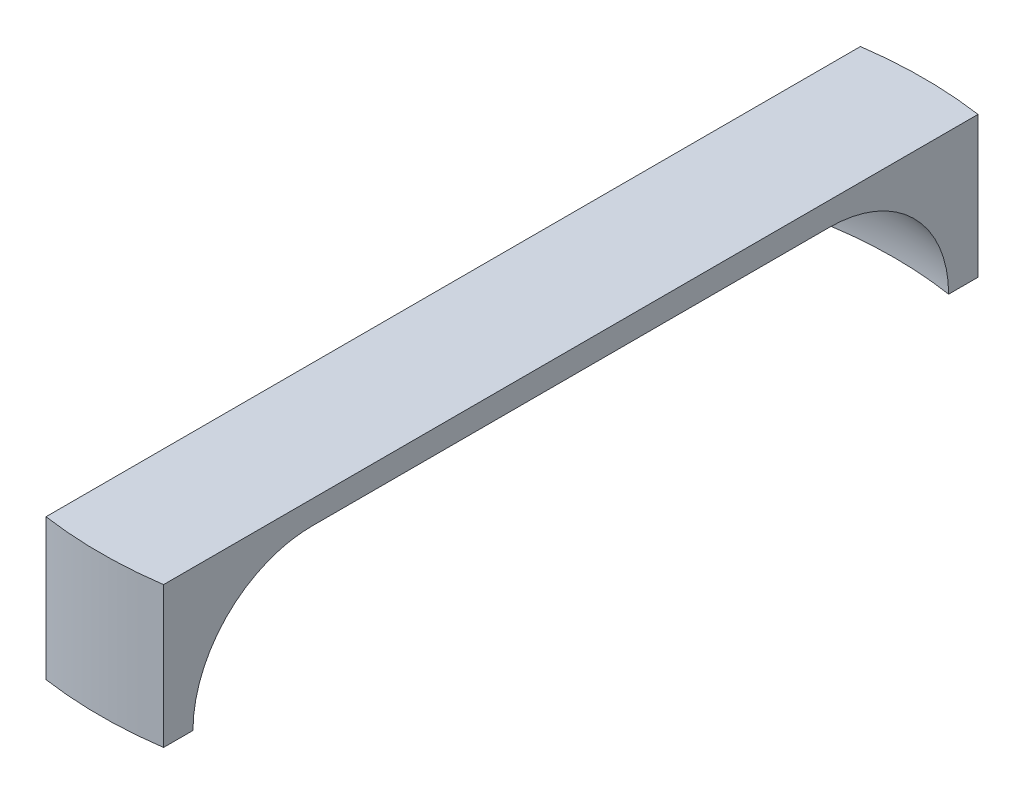
ISO-10303-21;
HEADER;
FILE_DESCRIPTION(('STEP AP214'),'2;1');
FILE_NAME('part.step','',(''),(''),'','','');
FILE_SCHEMA(('AUTOMOTIVE_DESIGN { 1 0 10303 214 1 1 1 1 }'));
ENDSEC;
DATA;
#1=APPLICATION_CONTEXT('core data for automotive mechanical design processes');
#2=APPLICATION_PROTOCOL_DEFINITION('international standard','automotive_design',2000,#1);
#3=PRODUCT_CONTEXT('',#1,'mechanical');
#4=PRODUCT('Part','Part','',(#3));
#5=PRODUCT_RELATED_PRODUCT_CATEGORY('part','',(#4));
#6=PRODUCT_DEFINITION_FORMATION('','',#4);
#7=PRODUCT_DEFINITION_CONTEXT('part definition',#1,'design');
#8=PRODUCT_DEFINITION('design','',#6,#7);
#9=PRODUCT_DEFINITION_SHAPE('','',#8);
#10=(LENGTH_UNIT() NAMED_UNIT(*) SI_UNIT(.MILLI.,.METRE.));
#11=(NAMED_UNIT(*) PLANE_ANGLE_UNIT() SI_UNIT($,.RADIAN.));
#12=(NAMED_UNIT(*) SI_UNIT($,.STERADIAN.) SOLID_ANGLE_UNIT());
#13=UNCERTAINTY_MEASURE_WITH_UNIT(LENGTH_MEASURE(1.E-05),#10,'distance_accuracy_value','');
#14=(GEOMETRIC_REPRESENTATION_CONTEXT(3) GLOBAL_UNCERTAINTY_ASSIGNED_CONTEXT((#13)) GLOBAL_UNIT_ASSIGNED_CONTEXT((#10,
#11,#12)) REPRESENTATION_CONTEXT('',''));
#15=CARTESIAN_POINT('',(0.,0.,0.));
#16=DIRECTION('',(0.,0.,1.));
#17=DIRECTION('',(1.,0.,0.));
#18=AXIS2_PLACEMENT_3D('',#15,#16,#17);
#19=CARTESIAN_POINT('',(0.,0.,0.));
#20=DIRECTION('',(0.,-1.,0.));
#21=DIRECTION('',(0.,0.,-1.));
#22=AXIS2_PLACEMENT_3D('',#19,#20,#21);
#23=PLANE('',#22);
#24=DIRECTION('',(0.,0.,-1.));
#25=VECTOR('',#24,1.);
#26=CARTESIAN_POINT('',(10.,0.,-69.2820323027551));
#27=LINE('',#26,#25);
#28=CARTESIAN_POINT('',(10.,0.,43.931440715182));
#29=VERTEX_POINT('',#28);
#30=CARTESIAN_POINT('',(10.,0.,-43.931440715182));
#31=VERTEX_POINT('',#30);
#32=EDGE_CURVE('E143',#29,#31,#27,.T.);
#33=ORIENTED_EDGE('',*,*,#32,.F.);
#34=CARTESIAN_POINT('',(0.,0.,0.));
#35=DIRECTION('',(0.,-1.,0.));
#36=DIRECTION('',(0.,0.,-1.));
#37=AXIS2_PLACEMENT_3D('',#34,#35,#36);
#38=CIRCLE('',#37,45.0552048415225);
#39=CARTESIAN_POINT('',(-10.,0.,43.931440715182));
#40=VERTEX_POINT('',#39);
#41=EDGE_CURVE('E55',#29,#40,#38,.T.);
#42=ORIENTED_EDGE('',*,*,#41,.T.);
#43=DIRECTION('',(0.,0.,1.));
#44=VECTOR('',#43,1.);
#45=CARTESIAN_POINT('',(-10.,0.,-69.2820323027551));
#46=LINE('',#45,#44);
#47=CARTESIAN_POINT('',(-10.,0.,-43.931440715182));
#48=VERTEX_POINT('',#47);
#49=EDGE_CURVE('E148',#48,#40,#46,.T.);
#50=ORIENTED_EDGE('',*,*,#49,.F.);
#51=CARTESIAN_POINT('',(0.,0.,0.));
#52=DIRECTION('',(0.,-1.,0.));
#53=DIRECTION('',(0.,0.,-1.));
#54=AXIS2_PLACEMENT_3D('',#51,#52,#53);
#55=CIRCLE('',#54,45.0552048415225);
#56=EDGE_CURVE('E163',#48,#31,#55,.T.);
#57=ORIENTED_EDGE('',*,*,#56,.T.);
#58=EDGE_LOOP('',(#33,#42,#50,#57));
#59=FACE_BOUND('',#58,.T.);
#60=ADVANCED_FACE('F35',(#59),#23,.T.);
#61=CARTESIAN_POINT('',(0.,4.,0.));
#62=DIRECTION('',(0.,-1.,0.));
#63=DIRECTION('',(0.,0.,-1.));
#64=AXIS2_PLACEMENT_3D('',#61,#62,#63);
#65=CYLINDRICAL_SURFACE('',#64,70.);
#66=DIRECTION('',(0.,-1.,0.));
#67=VECTOR('',#66,1.);
#68=CARTESIAN_POINT('',(-10.,4.,69.2820323027551));
#69=LINE('',#68,#67);
#70=CARTESIAN_POINT('',(-10.,4.,69.2820323027551));
#71=VERTEX_POINT('',#70);
#72=CARTESIAN_POINT('',(-10.,-20.,69.2820323027551));
#73=VERTEX_POINT('',#72);
#74=EDGE_CURVE('E154',#71,#73,#69,.T.);
#75=ORIENTED_EDGE('',*,*,#74,.T.);
#76=CARTESIAN_POINT('',(0.,-20.,0.));
#77=DIRECTION('',(0.,-1.,0.));
#78=DIRECTION('',(0.,0.,-1.));
#79=AXIS2_PLACEMENT_3D('',#76,#77,#78);
#80=CIRCLE('',#79,70.);
#81=CARTESIAN_POINT('',(10.,-20.,69.2820323027551));
#82=VERTEX_POINT('',#81);
#83=EDGE_CURVE('E121',#82,#73,#80,.T.);
#84=ORIENTED_EDGE('',*,*,#83,.F.);
#85=DIRECTION('',(0.,-1.,0.));
#86=VECTOR('',#85,1.);
#87=CARTESIAN_POINT('',(10.,4.,69.2820323027551));
#88=LINE('',#87,#86);
#89=CARTESIAN_POINT('',(10.,4.,69.2820323027551));
#90=VERTEX_POINT('',#89);
#91=EDGE_CURVE('E117',#90,#82,#88,.T.);
#92=ORIENTED_EDGE('',*,*,#91,.F.);
#93=CARTESIAN_POINT('',(0.,4.,0.));
#94=DIRECTION('',(0.,1.,0.));
#95=DIRECTION('',(0.,0.,-1.));
#96=AXIS2_PLACEMENT_3D('',#93,#94,#95);
#97=CIRCLE('',#96,70.);
#98=EDGE_CURVE('E144',#71,#90,#97,.T.);
#99=ORIENTED_EDGE('',*,*,#98,.F.);
#100=EDGE_LOOP('',(#75,#84,#92,#99));
#101=FACE_BOUND('',#100,.T.);
#102=ADVANCED_FACE('F178',(#101),#65,.T.);
#103=CARTESIAN_POINT('',(10.,4.,-69.2820323027551));
#104=DIRECTION('',(-1.,0.,0.));
#105=DIRECTION('',(0.,0.,1.));
#106=AXIS2_PLACEMENT_3D('',#103,#104,#105);
#107=PLANE('',#106);
#108=ORIENTED_EDGE('',*,*,#91,.T.);
#109=DIRECTION('',(0.,0.,1.));
#110=VECTOR('',#109,1.);
#111=CARTESIAN_POINT('',(10.,-20.,69.2820323027551));
#112=LINE('',#111,#110);
#113=CARTESIAN_POINT('',(10.,-20.,64.2820323027551));
#114=VERTEX_POINT('',#113);
#115=EDGE_CURVE('E114',#114,#82,#112,.T.);
#116=ORIENTED_EDGE('',*,*,#115,.F.);
#117=CARTESIAN_POINT('',(10.,-20.,64.2820323027551));
#118=CARTESIAN_POINT('',(10.,-19.7213822906956,64.2820327805648));
#119=CARTESIAN_POINT('',(10.,-19.4427957540815,64.2761394636097));
#120=CARTESIAN_POINT('',(10.,-18.8861275624752,64.252583538269));
#121=CARTESIAN_POINT('',(10.,-18.6080458952483,64.2349212190047));
#122=CARTESIAN_POINT('',(10.,-17.7753547787992,64.1643207709864));
#123=CARTESIAN_POINT('',(10.,-17.2221448276563,64.0937691304236));
#124=CARTESIAN_POINT('',(10.,-16.1242237067101,63.9062964400513));
#125=CARTESIAN_POINT('',(10.,-15.5795044109415,63.7894229673086));
#126=CARTESIAN_POINT('',(10.,-14.7714169253622,63.5800570999904));
#127=CARTESIAN_POINT('',(10.,-14.5035416556201,63.5045885480528));
#128=CARTESIAN_POINT('',(10.,-13.9711402617083,63.3424143375278));
#129=CARTESIAN_POINT('',(10.,-13.7066150041821,63.2557058338311));
#130=CARTESIAN_POINT('',(10.,-12.9187623997687,62.9789349397263));
#131=CARTESIAN_POINT('',(10.,-12.4011822930906,62.7722334072331));
#132=CARTESIAN_POINT('',(10.,-11.3852352487672,62.3160431658329));
#133=CARTESIAN_POINT('',(10.,-10.8868684155709,62.0665542243612));
#134=CARTESIAN_POINT('',(10.,-10.1564287247783,61.6616946032974));
#135=CARTESIAN_POINT('',(10.,-9.91577279123313,61.5216184174548));
#136=CARTESIAN_POINT('',(10.,-9.44060667017812,61.2315388112206));
#137=CARTESIAN_POINT('',(10.,-9.20609492283176,61.081537945195));
#138=CARTESIAN_POINT('',(10.,-8.51225716021974,60.6169662223786));
#139=CARTESIAN_POINT('',(10.,-8.06258304367639,60.2878009637344));
#140=CARTESIAN_POINT('',(10.,-7.19056286658054,59.5917130630381));
#141=CARTESIAN_POINT('',(10.,-6.76833574057444,59.2246419061475));
#142=CARTESIAN_POINT('',(10.,-5.95601063145519,58.4564972033109));
#143=CARTESIAN_POINT('',(10.,-5.56591283384609,58.0554234610724));
#144=CARTESIAN_POINT('',(10.,-4.82041812281843,57.2221342838884));
#145=CARTESIAN_POINT('',(10.,-4.46502626467463,56.7899143280662));
#146=CARTESIAN_POINT('',(10.,-3.79132700273422,55.8974892786472));
#147=CARTESIAN_POINT('',(10.,-3.47301941335935,55.4372843251115));
#148=CARTESIAN_POINT('',(10.,-2.87210973022331,54.4867732335737));
#149=CARTESIAN_POINT('',(10.,-2.58995529280496,53.9961840944205));
#150=CARTESIAN_POINT('',(10.,-2.06741301783768,52.9932149671854));
#151=CARTESIAN_POINT('',(10.,-1.82702755573707,52.4808337418247));
#152=CARTESIAN_POINT('',(10.,-1.38953024363979,51.4380425732833));
#153=CARTESIAN_POINT('',(10.,-1.1924107848744,50.9076358190535));
#154=CARTESIAN_POINT('',(10.,-0.842532045945097,49.8324634426785));
#155=CARTESIAN_POINT('',(10.,-0.689764380619027,49.2877005559788));
#156=CARTESIAN_POINT('',(10.,-0.466381088863208,48.3440602979897));
#157=CARTESIAN_POINT('',(10.,-0.384757580362428,47.9477482664143));
#158=CARTESIAN_POINT('',(10.,-0.24477796682238,47.1510397577513));
#159=CARTESIAN_POINT('',(10.,-0.186420515109505,46.7506435184399));
#160=CARTESIAN_POINT('',(10.,-0.0931592200956664,45.9478125907846));
#161=CARTESIAN_POINT('',(10.,-0.0582165071317918,45.5453824037196));
#162=CARTESIAN_POINT('',(10.,-0.0116284519308462,44.7391145184016));
#163=CARTESIAN_POINT('',(10.,1.33993457781367E-05,44.3352766183214));
#164=CARTESIAN_POINT('',(10.,0.,43.931440715182));
#165=B_SPLINE_CURVE_WITH_KNOTS('',3,(#117,#118,#119,#120,#121,#122,#123,#124,#125,#126,#127,
#128,#129,#130,#131,#132,#133,#134,#135,#136,#137,#138,#139,#140,#141,#142,#143,#144,#145,#146,
#147,#148,#149,#150,#151,#152,#153,#154,#155,#156,#157,#158,#159,#160,#161,#162,#163,#164),
.UNSPECIFIED.,.F.,.F.,(4,2,2,2,2,2,2,2,2,2,2,2,2,2,2,2,2,2,2,2,2,2,2,4),(0.,0.835728601775882,
1.67143667351676,3.34239116788472,5.01163385717317,5.84632715085222,6.68123214007874,
8.35111648017794,10.0210098969755,10.8561566677647,11.6910893224239,13.36079876686,
15.0373179660065,16.7138468441376,18.3906195627206,20.0673838899845,21.7632339166193,
23.459180356597,25.1548283076776,26.8501554700178,28.0634047185153,29.2765837321618,
30.4877437841245,31.6990852798247),.UNSPECIFIED.);
#166=EDGE_CURVE('E103',#114,#29,#165,.T.);
#167=ORIENTED_EDGE('',*,*,#166,.T.);
#168=ORIENTED_EDGE('',*,*,#32,.T.);
#169=CARTESIAN_POINT('',(10.,0.,-43.931440715182));
#170=CARTESIAN_POINT('',(10.,2.69115547152669E-07,-44.2220826211795));
#171=CARTESIAN_POINT('',(10.,-0.00602408242177834,-44.5126942492163));
#172=CARTESIAN_POINT('',(10.,-0.0301411397681358,-45.093412982006));
#173=CARTESIAN_POINT('',(10.,-0.0482337182755929,-45.3835200920484));
#174=CARTESIAN_POINT('',(10.,-0.120635717277886,-46.2523446775789));
#175=CARTESIAN_POINT('',(10.,-0.193069390653045,-46.8296491839258));
#176=CARTESIAN_POINT('',(10.,-0.38607726556519,-47.9762074408642));
#177=CARTESIAN_POINT('',(10.,-0.506654905497027,-48.5454606134301));
#178=CARTESIAN_POINT('',(10.,-0.723122245288982,-49.3900334835622));
#179=CARTESIAN_POINT('',(10.,-0.801213790908864,-49.67001318811));
#180=CARTESIAN_POINT('',(10.,-0.969185169031868,-50.2264949727389));
#181=CARTESIAN_POINT('',(10.,-1.05906813282831,-50.5029961076114));
#182=CARTESIAN_POINT('',(10.,-1.34637115127903,-51.3269006346838));
#183=CARTESIAN_POINT('',(10.,-1.561339403178,-51.8682915851116));
#184=CARTESIAN_POINT('',(10.,-2.03668272157668,-52.9307589256081));
#185=CARTESIAN_POINT('',(10.,-2.29705708053283,-53.45183563207));
#186=CARTESIAN_POINT('',(10.,-2.72027419290437,-54.2150887664497));
#187=CARTESIAN_POINT('',(10.,-2.86678187885112,-54.4664353293452));
#188=CARTESIAN_POINT('',(10.,-3.17042062476606,-54.9625361226915));
#189=CARTESIAN_POINT('',(10.,-3.32754894112044,-55.2072920330238));
#190=CARTESIAN_POINT('',(10.,-3.81456201706946,-55.9310962769286));
#191=CARTESIAN_POINT('',(10.,-4.16010988311056,-56.3997442172947));
#192=CARTESIAN_POINT('',(10.,-4.88456115617287,-57.2981529836899));
#193=CARTESIAN_POINT('',(10.,-5.26284679138825,-57.7284136688066));
#194=CARTESIAN_POINT('',(10.,-6.05478705778698,-58.5550892027017));
#195=CARTESIAN_POINT('',(10.,-6.46844160408773,-58.9515041327027));
#196=CARTESIAN_POINT('',(10.,-7.32828593673895,-59.7075257814516));
#197=CARTESIAN_POINT('',(10.,-7.77448313709266,-60.0671240673403));
#198=CARTESIAN_POINT('',(10.,-8.69612336857042,-60.7466405064539));
#199=CARTESIAN_POINT('',(10.,-9.17156559347551,-61.0665597528071));
#200=CARTESIAN_POINT('',(10.,-10.1405383121382,-61.6595297806737));
#201=CARTESIAN_POINT('',(10.,-10.6336652399049,-61.9332401994761));
#202=CARTESIAN_POINT('',(10.,-11.6414259724988,-62.4377801443999));
#203=CARTESIAN_POINT('',(10.,-12.1560610406945,-62.66860714724));
#204=CARTESIAN_POINT('',(10.,-13.2027799786921,-63.0854666707443));
#205=CARTESIAN_POINT('',(10.,-13.7348518323623,-63.2715293316094));
#206=CARTESIAN_POINT('',(10.,-14.8127029458626,-63.5975948847674));
#207=CARTESIAN_POINT('',(10.,-15.3584783585646,-63.7376105520308));
#208=CARTESIAN_POINT('',(10.,-16.5817037522606,-63.9962973655275));
#209=CARTESIAN_POINT('',(10.,-17.2616483950434,-64.1034515188696));
#210=CARTESIAN_POINT('',(10.,-18.2862956752117,-64.2105863173175));
#211=CARTESIAN_POINT('',(10.,-18.6284162751022,-64.2373651480548));
#212=CARTESIAN_POINT('',(10.,-19.3136670527642,-64.2730892058618));
#213=CARTESIAN_POINT('',(10.,-19.6567974465467,-64.2820302898341));
#214=CARTESIAN_POINT('',(10.,-20.,-64.2820323027551));
#215=B_SPLINE_CURVE_WITH_KNOTS('',3,(#169,#170,#171,#172,#173,#174,#175,#176,#177,#178,#179,
#180,#181,#182,#183,#184,#185,#186,#187,#188,#189,#190,#191,#192,#193,#194,#195,#196,#197,#198,
#199,#200,#201,#202,#203,#204,#205,#206,#207,#208,#209,#210,#211,#212,#213,#214),.UNSPECIFIED.,
.F.,.F.,(4,2,2,2,2,2,2,2,2,2,2,2,2,2,2,2,2,2,2,2,2,2,4),(0.,0.871801984922606,1.74359477379588,
3.48692982081938,5.23038939739835,6.1021607454902,6.97416406895257,8.71944725842097,
10.4647032543328,11.3372532296086,12.2095786553358,13.9540138043165,15.6707100446953,
17.3874021652543,19.1044866188904,20.8215237576023,22.5114793342292,24.2015343172056,
25.8904481674853,27.5788930607274,29.6396995728631,30.6688078189556,31.6981550638207),.UNSPECIFIED.);
#216=CARTESIAN_POINT('',(10.,-20.,-64.2820323027551));
#217=VERTEX_POINT('',#216);
#218=EDGE_CURVE('E11',#31,#217,#215,.T.);
#219=ORIENTED_EDGE('',*,*,#218,.T.);
#220=DIRECTION('',(0.,0.,1.));
#221=VECTOR('',#220,1.);
#222=CARTESIAN_POINT('',(10.,-20.,-64.2820323027551));
#223=LINE('',#222,#221);
#224=CARTESIAN_POINT('',(10.,-20.,-69.2820323027551));
#225=VERTEX_POINT('',#224);
#226=EDGE_CURVE('E134',#225,#217,#223,.T.);
#227=ORIENTED_EDGE('',*,*,#226,.F.);
#228=DIRECTION('',(0.,-1.,0.));
#229=VECTOR('',#228,1.);
#230=CARTESIAN_POINT('',(10.,4.,-69.2820323027551));
#231=LINE('',#230,#229);
#232=CARTESIAN_POINT('',(10.,4.,-69.2820323027551));
#233=VERTEX_POINT('',#232);
#234=EDGE_CURVE('E160',#233,#225,#231,.T.);
#235=ORIENTED_EDGE('',*,*,#234,.F.);
#236=DIRECTION('',(0.,0.,-1.));
#237=VECTOR('',#236,1.);
#238=CARTESIAN_POINT('',(10.,4.,-69.2820323027551));
#239=LINE('',#238,#237);
#240=EDGE_CURVE('E147',#90,#233,#239,.T.);
#241=ORIENTED_EDGE('',*,*,#240,.F.);
#242=EDGE_LOOP('',(#108,#116,#167,#168,#219,#227,#235,#241));
#243=FACE_BOUND('',#242,.T.);
#244=ADVANCED_FACE('F115',(#243),#107,.F.);
#245=CARTESIAN_POINT('',(0.,4.,0.));
#246=DIRECTION('',(0.,-1.,0.));
#247=DIRECTION('',(0.,0.,-1.));
#248=AXIS2_PLACEMENT_3D('',#245,#246,#247);
#249=CYLINDRICAL_SURFACE('',#248,70.);
#250=ORIENTED_EDGE('',*,*,#234,.T.);
#251=CARTESIAN_POINT('',(0.,-20.,0.));
#252=DIRECTION('',(0.,-1.,0.));
#253=DIRECTION('',(0.,0.,-1.));
#254=AXIS2_PLACEMENT_3D('',#251,#252,#253);
#255=CIRCLE('',#254,70.);
#256=CARTESIAN_POINT('',(-9.99999999999999,-20.,-69.2820323027551));
#257=VERTEX_POINT('',#256);
#258=EDGE_CURVE('E131',#257,#225,#255,.T.);
#259=ORIENTED_EDGE('',*,*,#258,.F.);
#260=DIRECTION('',(0.,-1.,0.));
#261=VECTOR('',#260,1.);
#262=CARTESIAN_POINT('',(-9.99999999999999,4.,-69.2820323027551));
#263=LINE('',#262,#261);
#264=CARTESIAN_POINT('',(-9.99999999999999,4.,-69.2820323027551));
#265=VERTEX_POINT('',#264);
#266=EDGE_CURVE('E158',#265,#257,#263,.T.);
#267=ORIENTED_EDGE('',*,*,#266,.F.);
#268=CARTESIAN_POINT('',(0.,4.,0.));
#269=DIRECTION('',(0.,1.,0.));
#270=DIRECTION('',(0.,0.,1.));
#271=AXIS2_PLACEMENT_3D('',#268,#269,#270);
#272=CIRCLE('',#271,70.);
#273=EDGE_CURVE('E150',#233,#265,#272,.T.);
#274=ORIENTED_EDGE('',*,*,#273,.F.);
#275=EDGE_LOOP('',(#250,#259,#267,#274));
#276=FACE_BOUND('',#275,.T.);
#277=ADVANCED_FACE('F186',(#276),#249,.T.);
#278=CARTESIAN_POINT('',(-10.,4.,-69.2820323027551));
#279=DIRECTION('',(1.,0.,0.));
#280=DIRECTION('',(0.,0.,-1.));
#281=AXIS2_PLACEMENT_3D('',#278,#279,#280);
#282=PLANE('',#281);
#283=ORIENTED_EDGE('',*,*,#266,.T.);
#284=DIRECTION('',(0.,0.,-1.));
#285=VECTOR('',#284,1.);
#286=CARTESIAN_POINT('',(-9.99999999999999,-20.,-64.2820323027551));
#287=LINE('',#286,#285);
#288=CARTESIAN_POINT('',(-9.99999999999998,-20.,-64.2820323027551));
#289=VERTEX_POINT('',#288);
#290=EDGE_CURVE('E140',#289,#257,#287,.T.);
#291=ORIENTED_EDGE('',*,*,#290,.F.);
#292=CARTESIAN_POINT('',(-9.99999999999998,-20.,-64.2820323027551));
#293=CARTESIAN_POINT('',(-9.99999999999999,-19.7213822906956,-64.2820327805648));
#294=CARTESIAN_POINT('',(-10.,-19.4427957540815,-64.2761394636097));
#295=CARTESIAN_POINT('',(-10.,-18.8861275624752,-64.252583538269));
#296=CARTESIAN_POINT('',(-10.,-18.6080458952483,-64.2349212190047));
#297=CARTESIAN_POINT('',(-10.,-17.7753547787992,-64.1643207709864));
#298=CARTESIAN_POINT('',(-10.,-17.2221448276563,-64.0937691304236));
#299=CARTESIAN_POINT('',(-10.,-16.1242237067101,-63.9062964400513));
#300=CARTESIAN_POINT('',(-10.,-15.5795044109415,-63.7894229673086));
#301=CARTESIAN_POINT('',(-10.,-14.7714169253622,-63.5800570999904));
#302=CARTESIAN_POINT('',(-10.,-14.5035416556201,-63.5045885480528));
#303=CARTESIAN_POINT('',(-10.,-13.9711402617083,-63.3424143375277));
#304=CARTESIAN_POINT('',(-10.,-13.7066150041821,-63.2557058338311));
#305=CARTESIAN_POINT('',(-10.,-12.9187623997687,-62.9789349397263));
#306=CARTESIAN_POINT('',(-10.,-12.4011822930906,-62.7722334072331));
#307=CARTESIAN_POINT('',(-10.,-11.3852352487672,-62.3160431658329));
#308=CARTESIAN_POINT('',(-10.,-10.8868684155709,-62.0665542243612));
#309=CARTESIAN_POINT('',(-10.,-10.1564287247783,-61.6616946032974));
#310=CARTESIAN_POINT('',(-10.,-9.91577279123313,-61.5216184174548));
#311=CARTESIAN_POINT('',(-10.,-9.44060667017812,-61.2315388112206));
#312=CARTESIAN_POINT('',(-10.,-9.20609492283175,-61.081537945195));
#313=CARTESIAN_POINT('',(-10.,-8.51225716021973,-60.6169662223786));
#314=CARTESIAN_POINT('',(-10.,-8.06258304367638,-60.2878009637344));
#315=CARTESIAN_POINT('',(-10.,-7.19056286658054,-59.5917130630381));
#316=CARTESIAN_POINT('',(-10.,-6.76833574057443,-59.2246419061475));
#317=CARTESIAN_POINT('',(-10.,-5.95601063145519,-58.4564972033109));
#318=CARTESIAN_POINT('',(-10.,-5.56591283384608,-58.0554234610724));
#319=CARTESIAN_POINT('',(-10.,-4.82041812281843,-57.2221342838884));
#320=CARTESIAN_POINT('',(-10.,-4.46502626467463,-56.7899143280662));
#321=CARTESIAN_POINT('',(-10.,-3.79132700273422,-55.8974892786472));
#322=CARTESIAN_POINT('',(-10.,-3.47301941335934,-55.4372843251115));
#323=CARTESIAN_POINT('',(-10.,-2.8721097302233,-54.4867732335737));
#324=CARTESIAN_POINT('',(-10.,-2.58995529280496,-53.9961840944205));
#325=CARTESIAN_POINT('',(-10.,-2.06741301783768,-52.9932149671854));
#326=CARTESIAN_POINT('',(-10.,-1.82702755573707,-52.4808337418247));
#327=CARTESIAN_POINT('',(-10.,-1.38953024363979,-51.4380425732833));
#328=CARTESIAN_POINT('',(-10.,-1.1924107848744,-50.9076358190535));
#329=CARTESIAN_POINT('',(-10.,-0.842532045945101,-49.8324634426785));
#330=CARTESIAN_POINT('',(-10.,-0.689764380619031,-49.2877005559788));
#331=CARTESIAN_POINT('',(-10.,-0.466381088863211,-48.3440602979897));
#332=CARTESIAN_POINT('',(-10.,-0.384757580362431,-47.9477482664143));
#333=CARTESIAN_POINT('',(-10.,-0.244777966822381,-47.1510397577513));
#334=CARTESIAN_POINT('',(-10.,-0.186420515109505,-46.7506435184399));
#335=CARTESIAN_POINT('',(-10.,-0.0931592200956655,-45.9478125907846));
#336=CARTESIAN_POINT('',(-10.,-0.0582165071317904,-45.5453824037196));
#337=CARTESIAN_POINT('',(-10.,-0.0116284519308444,-44.7391145184017));
#338=CARTESIAN_POINT('',(-10.,1.33993457798245E-05,-44.3352766183214));
#339=CARTESIAN_POINT('',(-10.,0.,-43.931440715182));
#340=B_SPLINE_CURVE_WITH_KNOTS('',3,(#292,#293,#294,#295,#296,#297,#298,#299,#300,#301,#302,
#303,#304,#305,#306,#307,#308,#309,#310,#311,#312,#313,#314,#315,#316,#317,#318,#319,#320,#321,
#322,#323,#324,#325,#326,#327,#328,#329,#330,#331,#332,#333,#334,#335,#336,#337,#338,#339),
.UNSPECIFIED.,.F.,.F.,(4,2,2,2,2,2,2,2,2,2,2,2,2,2,2,2,2,2,2,2,2,2,2,4),(0.,0.835728601775882,
1.67143667351676,3.34239116788472,5.01163385717317,5.84632715085221,6.68123214007874,
8.35111648017796,10.0210098969755,10.8561566677647,11.6910893224239,13.36079876686,
15.0373179660065,16.7138468441376,18.3906195627206,20.0673838899845,21.7632339166193,
23.4591803565971,25.1548283076776,26.8501554700178,28.0634047185153,29.2765837321618,
30.4877437841245,31.6990852798247),.UNSPECIFIED.);
#341=EDGE_CURVE('E48',#289,#48,#340,.T.);
#342=ORIENTED_EDGE('',*,*,#341,.T.);
#343=ORIENTED_EDGE('',*,*,#49,.T.);
#344=CARTESIAN_POINT('',(-10.,0.,43.931440715182));
#345=CARTESIAN_POINT('',(-10.,2.69115547144604E-07,44.2220826211795));
#346=CARTESIAN_POINT('',(-10.,-0.00602408242177834,44.5126942492163));
#347=CARTESIAN_POINT('',(-10.,-0.0301411397681358,45.093412982006));
#348=CARTESIAN_POINT('',(-10.,-0.0482337182755929,45.3835200920484));
#349=CARTESIAN_POINT('',(-10.,-0.120635717277886,46.2523446775789));
#350=CARTESIAN_POINT('',(-10.,-0.193069390653045,46.8296491839258));
#351=CARTESIAN_POINT('',(-10.,-0.38607726556519,47.9762074408642));
#352=CARTESIAN_POINT('',(-10.,-0.506654905497027,48.5454606134301));
#353=CARTESIAN_POINT('',(-10.,-0.723122245288982,49.3900334835622));
#354=CARTESIAN_POINT('',(-10.,-0.801213790908864,49.67001318811));
#355=CARTESIAN_POINT('',(-10.,-0.969185169031868,50.2264949727389));
#356=CARTESIAN_POINT('',(-10.,-1.05906813282831,50.5029961076114));
#357=CARTESIAN_POINT('',(-10.,-1.34637115127903,51.3269006346838));
#358=CARTESIAN_POINT('',(-10.,-1.561339403178,51.8682915851116));
#359=CARTESIAN_POINT('',(-10.,-2.03668272157668,52.9307589256081));
#360=CARTESIAN_POINT('',(-10.,-2.29705708053283,53.45183563207));
#361=CARTESIAN_POINT('',(-10.,-2.72027419290437,54.2150887664497));
#362=CARTESIAN_POINT('',(-10.,-2.86678187885112,54.4664353293452));
#363=CARTESIAN_POINT('',(-10.,-3.17042062476606,54.9625361226915));
#364=CARTESIAN_POINT('',(-10.,-3.32754894112044,55.2072920330238));
#365=CARTESIAN_POINT('',(-10.,-3.81456201706946,55.9310962769286));
#366=CARTESIAN_POINT('',(-10.,-4.16010988311056,56.3997442172947));
#367=CARTESIAN_POINT('',(-10.,-4.88456115617288,57.2981529836899));
#368=CARTESIAN_POINT('',(-10.,-5.26284679138825,57.7284136688066));
#369=CARTESIAN_POINT('',(-10.,-6.05478705778698,58.5550892027017));
#370=CARTESIAN_POINT('',(-10.,-6.46844160408773,58.9515041327027));
#371=CARTESIAN_POINT('',(-10.,-7.32828593673894,59.7075257814516));
#372=CARTESIAN_POINT('',(-10.,-7.77448313709266,60.0671240673403));
#373=CARTESIAN_POINT('',(-10.,-8.69612336857042,60.7466405064539));
#374=CARTESIAN_POINT('',(-10.,-9.17156559347551,61.066559752807));
#375=CARTESIAN_POINT('',(-10.,-10.1405383121382,61.6595297806737));
#376=CARTESIAN_POINT('',(-10.,-10.6336652399049,61.9332401994761));
#377=CARTESIAN_POINT('',(-10.,-11.6414259724988,62.4377801443999));
#378=CARTESIAN_POINT('',(-10.,-12.1560610406945,62.66860714724));
#379=CARTESIAN_POINT('',(-10.,-13.2027799786921,63.0854666707443));
#380=CARTESIAN_POINT('',(-10.,-13.7348518323623,63.2715293316094));
#381=CARTESIAN_POINT('',(-10.,-14.8127029458626,63.5975948847674));
#382=CARTESIAN_POINT('',(-10.,-15.3584783585646,63.7376105520308));
#383=CARTESIAN_POINT('',(-10.,-16.5817037522606,63.9962973655275));
#384=CARTESIAN_POINT('',(-10.,-17.2616483950434,64.1034515188696));
#385=CARTESIAN_POINT('',(-10.,-18.2862956752117,64.2105863173175));
#386=CARTESIAN_POINT('',(-10.,-18.6284162751022,64.2373651480548));
#387=CARTESIAN_POINT('',(-10.,-19.3136670527642,64.2730892058618));
#388=CARTESIAN_POINT('',(-10.,-19.6567974465467,64.2820302898341));
#389=CARTESIAN_POINT('',(-10.,-20.,64.2820323027551));
#390=B_SPLINE_CURVE_WITH_KNOTS('',3,(#344,#345,#346,#347,#348,#349,#350,#351,#352,#353,#354,
#355,#356,#357,#358,#359,#360,#361,#362,#363,#364,#365,#366,#367,#368,#369,#370,#371,#372,#373,
#374,#375,#376,#377,#378,#379,#380,#381,#382,#383,#384,#385,#386,#387,#388,#389),.UNSPECIFIED.,
.F.,.F.,(4,2,2,2,2,2,2,2,2,2,2,2,2,2,2,2,2,2,2,2,2,2,4),(0.,0.871801984922606,1.74359477379588,
3.48692982081938,5.23038939739835,6.1021607454902,6.97416406895257,8.71944725842097,
10.4647032543328,11.3372532296086,12.2095786553358,13.9540138043165,15.6707100446953,
17.3874021652543,19.1044866188904,20.8215237576023,22.5114793342292,24.2015343172056,
25.8904481674853,27.5788930607274,29.6396995728631,30.6688078189556,31.6981550638207),.UNSPECIFIED.);
#391=CARTESIAN_POINT('',(-9.99999999999999,-20.,64.2820323027551));
#392=VERTEX_POINT('',#391);
#393=EDGE_CURVE('E111',#40,#392,#390,.T.);
#394=ORIENTED_EDGE('',*,*,#393,.T.);
#395=DIRECTION('',(0.,0.,-1.));
#396=VECTOR('',#395,1.);
#397=CARTESIAN_POINT('',(-10.,-20.,69.2820323027551));
#398=LINE('',#397,#396);
#399=EDGE_CURVE('E126',#73,#392,#398,.T.);
#400=ORIENTED_EDGE('',*,*,#399,.F.);
#401=ORIENTED_EDGE('',*,*,#74,.F.);
#402=DIRECTION('',(0.,0.,1.));
#403=VECTOR('',#402,1.);
#404=CARTESIAN_POINT('',(-10.,4.,-69.2820323027551));
#405=LINE('',#404,#403);
#406=EDGE_CURVE('E152',#265,#71,#405,.T.);
#407=ORIENTED_EDGE('',*,*,#406,.F.);
#408=EDGE_LOOP('',(#283,#291,#342,#343,#394,#400,#401,#407));
#409=FACE_BOUND('',#408,.T.);
#410=ADVANCED_FACE('F191',(#409),#282,.F.);
#411=CARTESIAN_POINT('',(0.,4.,0.));
#412=DIRECTION('',(0.,-1.,0.));
#413=DIRECTION('',(0.,0.,-1.));
#414=AXIS2_PLACEMENT_3D('',#411,#412,#413);
#415=PLANE('',#414);
#416=ORIENTED_EDGE('',*,*,#98,.T.);
#417=ORIENTED_EDGE('',*,*,#240,.T.);
#418=ORIENTED_EDGE('',*,*,#273,.T.);
#419=ORIENTED_EDGE('',*,*,#406,.T.);
#420=EDGE_LOOP('',(#416,#417,#418,#419));
#421=FACE_BOUND('',#420,.T.);
#422=ADVANCED_FACE('F197',(#421),#415,.F.);
#423=CARTESIAN_POINT('',(0.,-20.,0.));
#424=DIRECTION('',(0.,-1.,0.));
#425=DIRECTION('',(0.,0.,-1.));
#426=AXIS2_PLACEMENT_3D('',#423,#424,#425);
#427=PLANE('',#426);
#428=ORIENTED_EDGE('',*,*,#258,.T.);
#429=ORIENTED_EDGE('',*,*,#226,.T.);
#430=CARTESIAN_POINT('',(0.,-20.,0.));
#431=DIRECTION('',(0.,1.,0.));
#432=DIRECTION('',(0.,0.,1.));
#433=AXIS2_PLACEMENT_3D('',#430,#431,#432);
#434=CIRCLE('',#433,65.0552048415225);
#435=EDGE_CURVE('E137',#217,#289,#434,.T.);
#436=ORIENTED_EDGE('',*,*,#435,.T.);
#437=ORIENTED_EDGE('',*,*,#290,.T.);
#438=EDGE_LOOP('',(#428,#429,#436,#437));
#439=FACE_BOUND('',#438,.T.);
#440=ADVANCED_FACE('F212',(#439),#427,.T.);
#441=CARTESIAN_POINT('',(0.,-20.,0.));
#442=DIRECTION('',(0.,1.,0.));
#443=DIRECTION('',(0.,0.,1.));
#444=AXIS2_PLACEMENT_3D('',#441,#442,#443);
#445=PLANE('',#444);
#446=CARTESIAN_POINT('',(0.,-20.,0.));
#447=DIRECTION('',(0.,1.,0.));
#448=DIRECTION('',(0.,0.,1.));
#449=AXIS2_PLACEMENT_3D('',#446,#447,#448);
#450=CIRCLE('',#449,65.0552048415225);
#451=EDGE_CURVE('E108',#392,#114,#450,.T.);
#452=ORIENTED_EDGE('',*,*,#451,.T.);
#453=ORIENTED_EDGE('',*,*,#115,.T.);
#454=ORIENTED_EDGE('',*,*,#83,.T.);
#455=ORIENTED_EDGE('',*,*,#399,.T.);
#456=EDGE_LOOP('',(#452,#453,#454,#455));
#457=FACE_BOUND('',#456,.T.);
#458=ADVANCED_FACE('F124',(#457),#445,.F.);
#459=CARTESIAN_POINT('',(0.,-20.,0.));
#460=DIRECTION('',(0.,-1.,0.));
#461=DIRECTION('',(0.,0.,-1.));
#462=AXIS2_PLACEMENT_3D('',#459,#460,#461);
#463=TOROIDAL_SURFACE('',#462,45.0552048415225,20.);
#464=ORIENTED_EDGE('',*,*,#393,.F.);
#465=ORIENTED_EDGE('',*,*,#41,.F.);
#466=ORIENTED_EDGE('',*,*,#166,.F.);
#467=ORIENTED_EDGE('',*,*,#451,.F.);
#468=EDGE_LOOP('',(#464,#465,#466,#467));
#469=FACE_BOUND('',#468,.T.);
#470=ADVANCED_FACE('F106',(#469),#463,.F.);
#471=CARTESIAN_POINT('',(0.,-20.,0.));
#472=DIRECTION('',(0.,-1.,0.));
#473=DIRECTION('',(0.,0.,-1.));
#474=AXIS2_PLACEMENT_3D('',#471,#472,#473);
#475=TOROIDAL_SURFACE('',#474,45.0552048415225,20.);
#476=ORIENTED_EDGE('',*,*,#218,.F.);
#477=ORIENTED_EDGE('',*,*,#56,.F.);
#478=ORIENTED_EDGE('',*,*,#341,.F.);
#479=ORIENTED_EDGE('',*,*,#435,.F.);
#480=EDGE_LOOP('',(#476,#477,#478,#479));
#481=FACE_BOUND('',#480,.T.);
#482=ADVANCED_FACE('F37',(#481),#475,.F.);
#483=CLOSED_SHELL('',(#60,#102,#244,#277,#410,#422,#440,#458,#470,#482));
#484=MANIFOLD_SOLID_BREP('B2',#483);
#485=ADVANCED_BREP_SHAPE_REPRESENTATION('',(#18,#484),#14);
#486=SHAPE_DEFINITION_REPRESENTATION(#9,#485);
ENDSEC;
END-ISO-10303-21;
